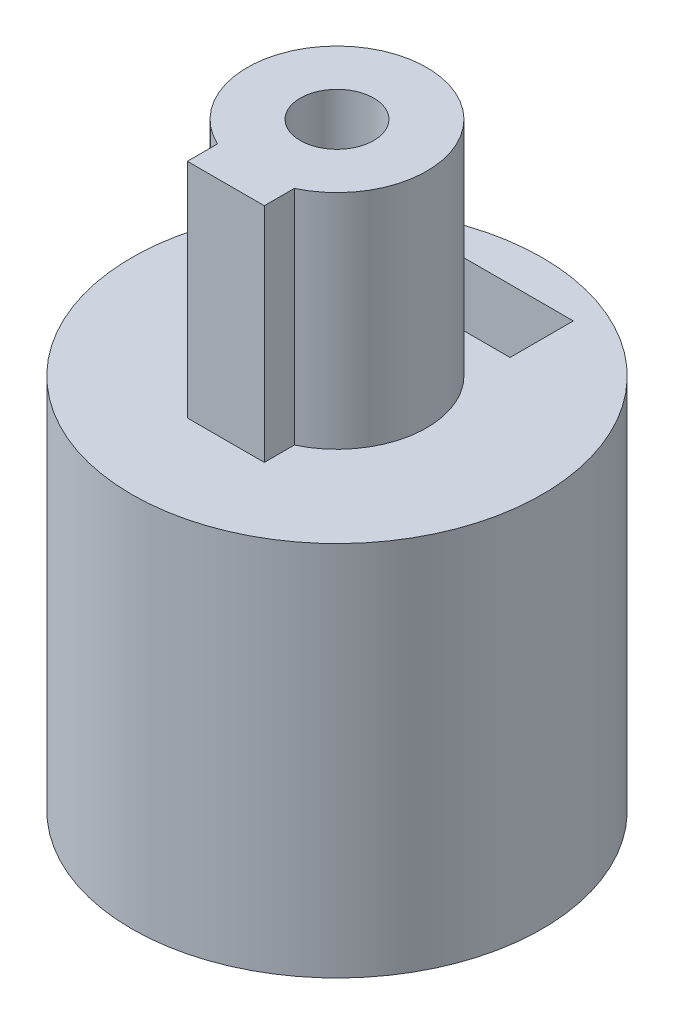
ISO-10303-21;
HEADER;
FILE_DESCRIPTION(('STEP AP214'),'2;1');
FILE_NAME('part.step','',(''),(''),'','','');
FILE_SCHEMA(('AUTOMOTIVE_DESIGN { 1 0 10303 214 1 1 1 1 }'));
ENDSEC;
DATA;
#1=APPLICATION_CONTEXT('core data for automotive mechanical design processes');
#2=APPLICATION_PROTOCOL_DEFINITION('international standard','automotive_design',2000,#1);
#3=PRODUCT_CONTEXT('',#1,'mechanical');
#4=PRODUCT('Part','Part','',(#3));
#5=PRODUCT_RELATED_PRODUCT_CATEGORY('part','',(#4));
#6=PRODUCT_DEFINITION_FORMATION('','',#4);
#7=PRODUCT_DEFINITION_CONTEXT('part definition',#1,'design');
#8=PRODUCT_DEFINITION('design','',#6,#7);
#9=PRODUCT_DEFINITION_SHAPE('','',#8);
#10=(LENGTH_UNIT() NAMED_UNIT(*) SI_UNIT(.MILLI.,.METRE.));
#11=(NAMED_UNIT(*) PLANE_ANGLE_UNIT() SI_UNIT($,.RADIAN.));
#12=(NAMED_UNIT(*) SI_UNIT($,.STERADIAN.) SOLID_ANGLE_UNIT());
#13=UNCERTAINTY_MEASURE_WITH_UNIT(LENGTH_MEASURE(1.E-05),#10,'distance_accuracy_value','');
#14=(GEOMETRIC_REPRESENTATION_CONTEXT(3) GLOBAL_UNCERTAINTY_ASSIGNED_CONTEXT((#13)) GLOBAL_UNIT_ASSIGNED_CONTEXT((#10,
#11,#12)) REPRESENTATION_CONTEXT('',''));
#15=CARTESIAN_POINT('',(0.,0.,0.));
#16=DIRECTION('',(0.,0.,1.));
#17=DIRECTION('',(1.,0.,0.));
#18=AXIS2_PLACEMENT_3D('',#15,#16,#17);
#19=CARTESIAN_POINT('',(0.,7.,-6.));
#20=DIRECTION('',(0.,0.,1.));
#21=DIRECTION('',(1.,0.,0.));
#22=AXIS2_PLACEMENT_3D('',#19,#20,#21);
#23=CYLINDRICAL_SURFACE('',#22,1.025);
#24=CARTESIAN_POINT('',(0.,8.025,-6.));
#25=CARTESIAN_POINT('',(-0.057129021805909,8.02499772840721,-5.99999900775209));
#26=CARTESIAN_POINT('',(-0.114288694426547,8.02020768113553,-5.99917558388442));
#27=CARTESIAN_POINT('',(-0.227003440677618,8.00118285182644,-5.99597008814761));
#28=CARTESIAN_POINT('',(-0.282557014382194,7.98693952098703,-5.99358660551168));
#29=CARTESIAN_POINT('',(-0.390412628331851,7.94945193314389,-5.98752819489086));
#30=CARTESIAN_POINT('',(-0.442717339459975,7.92621518637663,-5.98385434470439));
#31=CARTESIAN_POINT('',(-0.542679246717537,7.87142036283948,-5.97561861890346));
#32=CARTESIAN_POINT('',(-0.590336943676343,7.83986318416035,-5.97105683914425));
#33=CARTESIAN_POINT('',(-0.680135984205956,7.76898696325142,-5.96149941501592));
#34=CARTESIAN_POINT('',(-0.72222399560624,7.7296008182684,-5.95650024504773));
#35=CARTESIAN_POINT('',(-0.799228119899926,7.64432911453603,-5.94665830480908));
#36=CARTESIAN_POINT('',(-0.83414376866182,7.59844313549965,-5.94181554467714));
#37=CARTESIAN_POINT('',(-0.896027332048902,7.50110590633471,-5.93280057753614));
#38=CARTESIAN_POINT('',(-0.922942217268116,7.44962048335678,-5.92863292447034));
#39=CARTESIAN_POINT('',(-0.967721056978088,7.34277612409713,-5.92148911657744));
#40=CARTESIAN_POINT('',(-0.985585654718975,7.28741746342458,-5.91851287707366));
#41=CARTESIAN_POINT('',(-1.01158816944722,7.17496444613127,-5.91412405211724));
#42=CARTESIAN_POINT('',(-1.01981834503951,7.11789201196871,-5.91269664496829));
#43=CARTESIAN_POINT('',(-1.0266045006465,7.0031597815974,-5.91152229524133));
#44=CARTESIAN_POINT('',(-1.02516119995253,6.94550002937824,-5.91177522771819));
#45=CARTESIAN_POINT('',(-1.01271645572348,6.8318903608326,-5.91391945370944));
#46=CARTESIAN_POINT('',(-1.00181889187027,6.77592868044925,-5.91579294055823));
#47=CARTESIAN_POINT('',(-0.97093809525837,6.66663982621608,-5.92093928903694));
#48=CARTESIAN_POINT('',(-0.950954536531984,6.61331274696089,-5.92421220087215));
#49=CARTESIAN_POINT('',(-0.902364407216009,6.51049721851305,-5.9318077416241));
#50=CARTESIAN_POINT('',(-0.873714928690603,6.46102944752354,-5.93613557261378));
#51=CARTESIAN_POINT('',(-0.808636654316059,6.36756406826496,-5.94534973658277));
#52=CARTESIAN_POINT('',(-0.772207199569996,6.32356692381048,-5.95023611685009));
#53=CARTESIAN_POINT('',(-0.692038211440464,6.2416906191643,-5.96009492603012));
#54=CARTESIAN_POINT('',(-0.648209602257906,6.20389865817463,-5.96506764647446));
#55=CARTESIAN_POINT('',(-0.554787084587539,6.13619201555492,-5.97448004062525));
#56=CARTESIAN_POINT('',(-0.505193135382295,6.10627738956306,-5.9789197105666));
#57=CARTESIAN_POINT('',(-0.401564028575202,6.0551657177481,-5.9867725569888));
#58=CARTESIAN_POINT('',(-0.347524867685225,6.03397663545585,-5.99018479500469));
#59=CARTESIAN_POINT('',(-0.236583435115325,6.00099983015074,-5.99559083662011));
#60=CARTESIAN_POINT('',(-0.179681415700386,5.98921128033321,-5.9975847649625));
#61=CARTESIAN_POINT('',(-0.0653808172994131,5.9754889858301,-5.99991268288137));
#62=CARTESIAN_POINT('',(-0.00799700058598737,5.97343557927924,-6.00026682699029));
#63=CARTESIAN_POINT('',(0.106294577579118,5.97892246315691,-5.99933056568816));
#64=CARTESIAN_POINT('',(0.163202358214688,5.98646236508936,-5.99804022687302));
#65=CARTESIAN_POINT('',(0.274554949336557,6.01082231149179,-5.99397247481089));
#66=CARTESIAN_POINT('',(0.329013153116637,6.02758286365461,-5.99120459810796));
#67=CARTESIAN_POINT('',(0.434346698407185,6.06984473637203,-5.98449086136286));
#68=CARTESIAN_POINT('',(0.485221830138069,6.0953465681939,-5.98054493241952));
#69=CARTESIAN_POINT('',(0.58246311617523,6.15463939446082,-5.97186273771382));
#70=CARTESIAN_POINT('',(0.628783248246283,6.18850482598886,-5.96711950406798));
#71=CARTESIAN_POINT('',(0.715125836783952,6.26346146273558,-5.95738922262263));
#72=CARTESIAN_POINT('',(0.75514781070517,6.30455322110284,-5.95240215617974));
#73=CARTESIAN_POINT('',(0.828203708504393,6.39333374744174,-5.94268078613609));
#74=CARTESIAN_POINT('',(0.861156622624258,6.44108960234961,-5.93794983407302));
#75=CARTESIAN_POINT('',(0.918572497304516,6.54152931875124,-5.92933984229211));
#76=CARTESIAN_POINT('',(0.943035736678586,6.59421301833501,-5.92546077459866));
#77=CARTESIAN_POINT('',(0.982657874256186,6.70279040866835,-5.91901912534323));
#78=CARTESIAN_POINT('',(0.997856483411739,6.75866926003878,-5.91645093279999));
#79=CARTESIAN_POINT('',(1.01864245502096,6.87223450397019,-5.91290796951349));
#80=CARTESIAN_POINT('',(1.02423069968971,6.92992073012217,-5.91193305251065));
#81=CARTESIAN_POINT('',(1.02561176041543,7.04465383263375,-5.91169354428849));
#82=CARTESIAN_POINT('',(1.02153213625353,7.10169916696336,-5.91240668041866));
#83=CARTESIAN_POINT('',(1.00396974898029,7.21427885903823,-5.91541400302865));
#84=CARTESIAN_POINT('',(0.990487020878765,7.26981322240838,-5.91770818362188));
#85=CARTESIAN_POINT('',(0.954550985092882,7.37774153170815,-5.92361045759366));
#86=CARTESIAN_POINT('',(0.932109203860775,7.4301394137159,-5.92721686217777));
#87=CARTESIAN_POINT('',(0.878905351085741,7.53044701229056,-5.9353387767073));
#88=CARTESIAN_POINT('',(0.848142832774205,7.57835648767366,-5.93985433546496));
#89=CARTESIAN_POINT('',(0.778717727996033,7.66897074088246,-5.94935610169176));
#90=CARTESIAN_POINT('',(0.739961482891463,7.71160323040603,-5.95434747238202));
#91=CARTESIAN_POINT('',(0.655846210332251,7.78980307156242,-5.96419777785053));
#92=CARTESIAN_POINT('',(0.610485663211634,7.82536879264853,-5.96905668184154));
#93=CARTESIAN_POINT('',(0.514055463609574,7.88866371595542,-5.9781357643754));
#94=CARTESIAN_POINT('',(0.462946585113283,7.91633387123849,-5.98235102595813));
#95=CARTESIAN_POINT('',(0.356753960873555,7.9626528304007,-5.98962003307112));
#96=CARTESIAN_POINT('',(0.301674193065421,7.98131052229395,-5.99267492231261));
#97=CARTESIAN_POINT('',(0.205324889668461,8.00507473985857,-5.99662063052046));
#98=CARTESIAN_POINT('',(0.164634720196102,8.01253459518788,-5.99788104819846));
#99=CARTESIAN_POINT('',(0.0826350389649352,8.02249800067083,-5.99957108407766));
#100=CARTESIAN_POINT('',(0.0413255387647287,8.02500164320678,-6.00000071776442));
#101=CARTESIAN_POINT('',(0.,8.025,-6.));
#102=B_SPLINE_CURVE_WITH_KNOTS('',3,(#24,#25,#26,#27,#28,#29,#30,#31,#32,#33,#34,#35,#36,#37,
#38,#39,#40,#41,#42,#43,#44,#45,#46,#47,#48,#49,#50,#51,#52,#53,#54,#55,#56,#57,#58,#59,#60,#61,
#62,#63,#64,#65,#66,#67,#68,#69,#70,#71,#72,#73,#74,#75,#76,#77,#78,#79,#80,#81,#82,#83,#84,#85,
#86,#87,#88,#89,#90,#91,#92,#93,#94,#95,#96,#97,#98,#99,#100,#101),.UNSPECIFIED.,.T.,.F.,(4,2,2,
2,2,2,2,2,2,2,2,2,2,2,2,2,2,2,2,2,2,2,2,2,2,2,2,2,2,2,2,2,2,2,2,2,2,2,4),(0.,0.171235994893447,
0.342627053456379,0.513875294237687,0.685105058388228,0.857871180813246,1.03064847960544,
1.20454664979448,1.37843245841822,1.55063916189725,1.72283306073277,1.89315858532088,
2.06349022096238,2.23467942944234,2.40588314192621,2.57931792140326,2.75275392582942,
2.92634787091466,3.0999265462136,3.27136600700557,3.44279852530835,3.61313770472599,
3.78348684878489,3.95541050932786,4.12734733572354,4.30116013270972,4.4749672208821,
4.64802398347102,4.821064858896,4.99183533604723,5.16260517738581,5.33315601574305,
5.50371601337198,5.67640118185052,5.84912614859001,6.02311087172201,6.19692366051839,
6.32079330552967,6.44466064162599),.UNSPECIFIED.);
#103=CARTESIAN_POINT('',(0.,8.025,-6.));
#104=VERTEX_POINT('',#103);
#105=EDGE_CURVE('E251',#104,#104,#102,.T.);
#106=ORIENTED_EDGE('',*,*,#105,.F.);
#107=EDGE_LOOP('',(#106));
#108=FACE_BOUND('',#107,.T.);
#109=CARTESIAN_POINT('',(0.,7.,-4.85));
#110=DIRECTION('',(0.,0.,1.));
#111=DIRECTION('',(1.,0.,0.));
#112=AXIS2_PLACEMENT_3D('',#109,#110,#111);
#113=CIRCLE('',#112,1.025);
#114=CARTESIAN_POINT('',(1.025,7.,-4.85));
#115=VERTEX_POINT('',#114);
#116=EDGE_CURVE('E186',#115,#115,#113,.F.);
#117=ORIENTED_EDGE('',*,*,#116,.F.);
#118=EDGE_LOOP('',(#117));
#119=FACE_BOUND('',#118,.T.);
#120=ADVANCED_FACE('F49',(#108,#119),#23,.F.);
#121=CARTESIAN_POINT('',(0.,11.,0.));
#122=DIRECTION('',(0.,1.,0.));
#123=DIRECTION('',(0.,0.,1.));
#124=AXIS2_PLACEMENT_3D('',#121,#122,#123);
#125=PLANE('',#124);
#126=DIRECTION('',(0.,0.,1.));
#127=VECTOR('',#126,1.);
#128=CARTESIAN_POINT('',(-1.125,11.,0.));
#129=LINE('',#128,#127);
#130=CARTESIAN_POINT('',(-1.125,11.,2.37170824512628));
#131=VERTEX_POINT('',#130);
#132=CARTESIAN_POINT('',(-1.125,11.,3.25));
#133=VERTEX_POINT('',#132);
#134=EDGE_CURVE('E73',#131,#133,#129,.T.);
#135=ORIENTED_EDGE('',*,*,#134,.F.);
#136=CARTESIAN_POINT('',(0.,11.,0.));
#137=DIRECTION('',(0.,1.,0.));
#138=DIRECTION('',(0.,0.,1.));
#139=AXIS2_PLACEMENT_3D('',#136,#137,#138);
#140=CIRCLE('',#139,2.625);
#141=CARTESIAN_POINT('',(1.125,11.,2.37170824512628));
#142=VERTEX_POINT('',#141);
#143=EDGE_CURVE('E193',#142,#131,#140,.T.);
#144=ORIENTED_EDGE('',*,*,#143,.F.);
#145=DIRECTION('',(0.,0.,1.));
#146=VECTOR('',#145,1.);
#147=CARTESIAN_POINT('',(1.125,11.,0.));
#148=LINE('',#147,#146);
#149=CARTESIAN_POINT('',(1.125,11.,3.25));
#150=VERTEX_POINT('',#149);
#151=EDGE_CURVE('E199',#142,#150,#148,.T.);
#152=ORIENTED_EDGE('',*,*,#151,.T.);
#153=DIRECTION('',(1.,0.,0.));
#154=VECTOR('',#153,1.);
#155=CARTESIAN_POINT('',(0.,11.,3.25));
#156=LINE('',#155,#154);
#157=EDGE_CURVE('E206',#133,#150,#156,.T.);
#158=ORIENTED_EDGE('',*,*,#157,.F.);
#159=EDGE_LOOP('',(#135,#144,#152,#158));
#160=FACE_BOUND('',#159,.T.);
#161=CARTESIAN_POINT('',(0.,11.,0.));
#162=DIRECTION('',(0.,1.,0.));
#163=DIRECTION('',(0.,0.,1.));
#164=AXIS2_PLACEMENT_3D('',#161,#162,#163);
#165=CIRCLE('',#164,6.);
#166=CARTESIAN_POINT('',(0.,11.,6.));
#167=VERTEX_POINT('',#166);
#168=EDGE_CURVE('E221',#167,#167,#165,.T.);
#169=ORIENTED_EDGE('',*,*,#168,.T.);
#170=EDGE_LOOP('',(#169));
#171=FACE_BOUND('',#170,.T.);
#172=DIRECTION('',(0.,0.,-1.));
#173=VECTOR('',#172,1.);
#174=CARTESIAN_POINT('',(-2.06,11.,0.));
#175=LINE('',#174,#173);
#176=CARTESIAN_POINT('',(-2.06,11.,-3.));
#177=VERTEX_POINT('',#176);
#178=CARTESIAN_POINT('',(-2.06,11.,-4.85));
#179=VERTEX_POINT('',#178);
#180=EDGE_CURVE('E369',#177,#179,#175,.T.);
#181=ORIENTED_EDGE('',*,*,#180,.T.);
#182=DIRECTION('',(1.,0.,0.));
#183=VECTOR('',#182,1.);
#184=CARTESIAN_POINT('',(0.,11.,-4.85));
#185=LINE('',#184,#183);
#186=CARTESIAN_POINT('',(2.06,11.,-4.85));
#187=VERTEX_POINT('',#186);
#188=EDGE_CURVE('E12',#179,#187,#185,.T.);
#189=ORIENTED_EDGE('',*,*,#188,.T.);
#190=DIRECTION('',(0.,0.,-1.));
#191=VECTOR('',#190,1.);
#192=CARTESIAN_POINT('',(2.06,11.,0.));
#193=LINE('',#192,#191);
#194=CARTESIAN_POINT('',(2.06,11.,-3.));
#195=VERTEX_POINT('',#194);
#196=EDGE_CURVE('E58',#195,#187,#193,.T.);
#197=ORIENTED_EDGE('',*,*,#196,.F.);
#198=DIRECTION('',(1.,0.,0.));
#199=VECTOR('',#198,1.);
#200=CARTESIAN_POINT('',(0.,11.,-3.));
#201=LINE('',#200,#199);
#202=EDGE_CURVE('E366',#177,#195,#201,.T.);
#203=ORIENTED_EDGE('',*,*,#202,.F.);
#204=EDGE_LOOP('',(#181,#189,#197,#203));
#205=FACE_BOUND('',#204,.T.);
#206=ADVANCED_FACE('F265',(#160,#171,#205),#125,.T.);
#207=CARTESIAN_POINT('',(0.,7.,-3.));
#208=DIRECTION('',(0.,0.,1.));
#209=DIRECTION('',(1.,0.,0.));
#210=AXIS2_PLACEMENT_3D('',#207,#208,#209);
#211=CIRCLE('',#210,1.025);
#212=CARTESIAN_POINT('',(1.025,7.,-3.));
#213=VERTEX_POINT('',#212);
#214=EDGE_CURVE('E182',#213,#213,#211,.F.);
#215=ORIENTED_EDGE('',*,*,#214,.T.);
#216=EDGE_LOOP('',(#215));
#217=FACE_BOUND('',#216,.T.);
#218=CARTESIAN_POINT('',(1.025,7.,-1.8328597873269));
#219=CARTESIAN_POINT('',(1.02499645606672,6.94639441501386,-1.8328640935936));
#220=CARTESIAN_POINT('',(1.02076698915576,6.89271673931753,-1.83524689686831));
#221=CARTESIAN_POINT('',(1.00405753177462,6.78699322302765,-1.84443863790037));
#222=CARTESIAN_POINT('',(0.991559385204819,6.73495123803985,-1.85125731525541));
#223=CARTESIAN_POINT('',(0.958969452031826,6.63422602594403,-1.86834445087353));
#224=CARTESIAN_POINT('',(0.938916546275438,6.58552708573205,-1.87859521620438));
#225=CARTESIAN_POINT('',(0.891904667350708,6.49219655437279,-1.90136426661631));
#226=CARTESIAN_POINT('',(0.86494560626241,6.44756501501604,-1.91388258056418));
#227=CARTESIAN_POINT('',(0.802406461176824,6.35976841775886,-1.94097712724614));
#228=CARTESIAN_POINT('',(0.76631621169833,6.31699262925037,-1.95563775587243));
#229=CARTESIAN_POINT('',(0.687601665544952,6.23780053169204,-1.98468238424946));
#230=CARTESIAN_POINT('',(0.644974255849895,6.20138727026928,-1.99906624851168));
#231=CARTESIAN_POINT('',(0.551085323966481,6.13369416463791,-2.02702988673331));
#232=CARTESIAN_POINT('',(0.499447438646706,6.1028870633247,-2.04050061684691));
#233=CARTESIAN_POINT('',(0.390941700361152,6.05057369031554,-2.06403433745223));
#234=CARTESIAN_POINT('',(0.334077021041106,6.02906181932189,-2.0740993786814));
#235=CARTESIAN_POINT('',(0.220850829971725,5.99747108161938,-2.0890810601881));
#236=CARTESIAN_POINT('',(0.164720524014055,5.9867113351402,-2.09430254212573));
#237=CARTESIAN_POINT('',(0.051226688237023,5.97469434357093,-2.10014221364635));
#238=CARTESIAN_POINT('',(-0.00613611638643622,5.9734316561337,-2.10076303966004));
#239=CARTESIAN_POINT('',(-0.115373787896629,5.98016733482283,-2.09748142204962));
#240=CARTESIAN_POINT('',(-0.167309127918126,5.98740606138804,-2.09394997215738));
#241=CARTESIAN_POINT('',(-0.269118447664813,6.00958845399914,-2.08331360243167));
#242=CARTESIAN_POINT('',(-0.318992273374222,6.02453269460435,-2.07620841612459));
#243=CARTESIAN_POINT('',(-0.416153475149913,6.06181599855391,-2.05895316401618));
#244=CARTESIAN_POINT('',(-0.463393645521308,6.0842577879692,-2.04876099467317));
#245=CARTESIAN_POINT('',(-0.553555137985415,6.13576603981873,-2.02626233951311));
#246=CARTESIAN_POINT('',(-0.596474885223051,6.16483490540072,-2.01395508711223));
#247=CARTESIAN_POINT('',(-0.680950591937614,6.23182288394922,-1.98706966262833));
#248=CARTESIAN_POINT('',(-0.722025366910624,6.27030729322842,-1.97238674800569));
#249=CARTESIAN_POINT('',(-0.797390648207704,6.35351140450009,-1.94314322644075));
#250=CARTESIAN_POINT('',(-0.831676359665604,6.398235475605,-1.92858271284636));
#251=CARTESIAN_POINT('',(-0.894440298131244,6.49585680971974,-1.90032382253067));
#252=CARTESIAN_POINT('',(-0.922462951327314,6.54907869752364,-1.88672531915229));
#253=CARTESIAN_POINT('',(-0.96894590420928,6.66030599943166,-1.86328435122403));
#254=CARTESIAN_POINT('',(-0.987415779354138,6.71830655563035,-1.8534381281014));
#255=CARTESIAN_POINT('',(-1.01281094431499,6.83267702014528,-1.83967626974392));
#256=CARTESIAN_POINT('',(-1.02052340819776,6.88882204147189,-1.83535842629193));
#257=CARTESIAN_POINT('',(-1.02655429914469,7.00175736510262,-1.83199386873751));
#258=CARTESIAN_POINT('',(-1.02487867862491,7.05854723575392,-1.8329438146448));
#259=CARTESIAN_POINT('',(-1.01290336244989,7.16500613780785,-1.83958207082481));
#260=CARTESIAN_POINT('',(-1.00349913481734,7.21481145819679,-1.84477807629652));
#261=CARTESIAN_POINT('',(-0.97764080378385,7.31205146938064,-1.85861017566643));
#262=CARTESIAN_POINT('',(-0.961184545663605,7.35948543066588,-1.8672473209342));
#263=CARTESIAN_POINT('',(-0.920877212448492,7.45313319715334,-1.88746229884837));
#264=CARTESIAN_POINT('',(-0.896718260907304,7.49918808483605,-1.8991580519879));
#265=CARTESIAN_POINT('',(-0.841964328451563,7.58685190346573,-1.92405824492246));
#266=CARTESIAN_POINT('',(-0.811366070887822,7.62845855460489,-1.93726345123587));
#267=CARTESIAN_POINT('',(-0.740342279000108,7.71121992313739,-1.96558410337199));
#268=CARTESIAN_POINT('',(-0.69918069475161,7.75173205120026,-1.98073991430063));
#269=CARTESIAN_POINT('',(-0.610382766986843,7.82546278133421,-2.00987952889889));
#270=CARTESIAN_POINT('',(-0.562744561425936,7.85867927868379,-2.02386299364009));
#271=CARTESIAN_POINT('',(-0.460883657472091,7.91746450829215,-2.04948776215532));
#272=CARTESIAN_POINT('',(-0.406539905583028,7.94285042833359,-2.06107126229387));
#273=CARTESIAN_POINT('',(-0.293626072478352,7.98387415378924,-2.08015652924546));
#274=CARTESIAN_POINT('',(-0.235059573883659,7.9995201165781,-2.08766171104581));
#275=CARTESIAN_POINT('',(-0.120985244570837,8.01933122776103,-2.097222972226));
#276=CARTESIAN_POINT('',(-0.0656684200114454,8.02439343629108,-2.09970419445187));
#277=CARTESIAN_POINT('',(0.0450695482203038,8.02550307041801,-2.10024529201488));
#278=CARTESIAN_POINT('',(0.100490653193746,8.02155335778316,-2.0983065709212));
#279=CARTESIAN_POINT('',(0.206321200093286,8.00535989483666,-2.09047330467869));
#280=CARTESIAN_POINT('',(0.256830362999739,7.99363561192035,-2.08482672187127));
#281=CARTESIAN_POINT('',(0.355092191206429,7.96290490339736,-2.07035688277301));
#282=CARTESIAN_POINT('',(0.402844441603459,7.94389738496598,-2.06153314977358));
#283=CARTESIAN_POINT('',(0.496586623318674,7.89825594380281,-2.04103045697026));
#284=CARTESIAN_POINT('',(0.542406774569577,7.87132346786946,-2.02924302326906));
#285=CARTESIAN_POINT('',(0.629072329503909,7.81097754898362,-2.00407282256472));
#286=CARTESIAN_POINT('',(0.669915429297153,7.77756112300753,-1.99068932236731));
#287=CARTESIAN_POINT('',(0.749562379479787,7.70149527070206,-1.96217008137833));
#288=CARTESIAN_POINT('',(0.787801132441636,7.65826948400864,-1.94698888727679));
#289=CARTESIAN_POINT('',(0.856672139734532,7.56574344799832,-1.91768544090081));
#290=CARTESIAN_POINT('',(0.887298192258421,7.5164382946262,-1.90356405851341));
#291=CARTESIAN_POINT('',(0.940664590894157,7.41149172262077,-1.87777865534351));
#292=CARTESIAN_POINT('',(0.963192351888686,7.35572424310986,-1.86618365252134));
#293=CARTESIAN_POINT('',(0.998195400216386,7.24047893595184,-1.84770353057538));
#294=CARTESIAN_POINT('',(1.01070439407466,7.18101428083051,-1.84080263081204));
#295=CARTESIAN_POINT('',(1.02023257777911,7.10079837224774,-1.83551880194986));
#296=CARTESIAN_POINT('',(1.02201786408671,7.0806969803855,-1.83452480173931));
#297=CARTESIAN_POINT('',(1.0244022799265,7.04040047690318,-1.83319446243567));
#298=CARTESIAN_POINT('',(1.02500133580197,7.02020535954143,-1.83285816418134));
#299=CARTESIAN_POINT('',(1.025,7.,-1.8328597873269));
#300=B_SPLINE_CURVE_WITH_KNOTS('',3,(#218,#219,#220,#221,#222,#223,#224,#225,#226,#227,#228,
#229,#230,#231,#232,#233,#234,#235,#236,#237,#238,#239,#240,#241,#242,#243,#244,#245,#246,#247,
#248,#249,#250,#251,#252,#253,#254,#255,#256,#257,#258,#259,#260,#261,#262,#263,#264,#265,#266,
#267,#268,#269,#270,#271,#272,#273,#274,#275,#276,#277,#278,#279,#280,#281,#282,#283,#284,#285,
#286,#287,#288,#289,#290,#291,#292,#293,#294,#295,#296,#297,#298,#299),.UNSPECIFIED.,.T.,.F.,(4,
2,2,2,2,2,2,2,2,2,2,2,2,2,2,2,2,2,2,2,2,2,2,2,2,2,2,2,2,2,2,2,2,2,2,2,2,2,2,2,4),(0.,
0.160731801023403,0.32181770831564,0.482085661754884,0.642355655613302,0.815190188583738,
0.988107283055588,1.17200361229614,1.35578901037865,1.52701416065222,1.69814118183609,
1.85507088468206,2.01201229063649,2.17119877081237,2.33044306816614,2.50420740726671,
2.67809403541448,2.86212648314324,3.04597410221588,3.21550139929675,3.38492122154889,
3.53709084957253,3.68930700559683,3.8485908324795,4.00795590797556,4.18627953834882,
4.36465454605353,4.54692411187511,4.72904081783061,4.89496590268103,5.06083830475238,
5.21661452596801,5.37241413003437,5.53506342110908,5.69778771924206,5.87601659912541,
6.05439020359655,6.23715299662205,6.41929830006472,6.47987859580963,6.54046265305402),.UNSPECIFIED.);
#301=CARTESIAN_POINT('',(1.025,7.,-1.8328597873269));
#302=VERTEX_POINT('',#301);
#303=EDGE_CURVE('E244',#302,#302,#300,.T.);
#304=ORIENTED_EDGE('',*,*,#303,.F.);
#305=EDGE_LOOP('',(#304));
#306=FACE_BOUND('',#305,.T.);
#307=ADVANCED_FACE('F262',(#217,#306),#23,.F.);
#308=CARTESIAN_POINT('',(0.,10.,0.));
#309=DIRECTION('',(0.,-1.,0.));
#310=DIRECTION('',(0.,0.,-1.));
#311=AXIS2_PLACEMENT_3D('',#308,#309,#310);
#312=CYLINDRICAL_SURFACE('',#311,6.);
#313=ORIENTED_EDGE('',*,*,#105,.T.);
#314=EDGE_LOOP('',(#313));
#315=FACE_BOUND('',#314,.T.);
#316=CARTESIAN_POINT('',(0.,0.,0.));
#317=DIRECTION('',(0.,1.,0.));
#318=DIRECTION('',(0.,0.,1.));
#319=AXIS2_PLACEMENT_3D('',#316,#317,#318);
#320=CIRCLE('',#319,6.);
#321=CARTESIAN_POINT('',(0.,0.,6.));
#322=VERTEX_POINT('',#321);
#323=EDGE_CURVE('E248',#322,#322,#320,.T.);
#324=ORIENTED_EDGE('',*,*,#323,.T.);
#325=EDGE_LOOP('',(#324));
#326=FACE_BOUND('',#325,.T.);
#327=ORIENTED_EDGE('',*,*,#168,.F.);
#328=EDGE_LOOP('',(#327));
#329=FACE_BOUND('',#328,.T.);
#330=ADVANCED_FACE('F51',(#315,#326,#329),#312,.T.);
#331=CARTESIAN_POINT('',(0.,0.,0.));
#332=DIRECTION('',(0.,1.,0.));
#333=DIRECTION('',(0.,0.,1.));
#334=AXIS2_PLACEMENT_3D('',#331,#332,#333);
#335=PLANE('',#334);
#336=CARTESIAN_POINT('',(0.,0.,0.));
#337=DIRECTION('',(0.,1.,0.));
#338=DIRECTION('',(0.,0.,1.));
#339=AXIS2_PLACEMENT_3D('',#336,#337,#338);
#340=CIRCLE('',#339,2.1);
#341=CARTESIAN_POINT('',(0.,0.,2.1));
#342=VERTEX_POINT('',#341);
#343=EDGE_CURVE('E236',#342,#342,#340,.T.);
#344=ORIENTED_EDGE('',*,*,#343,.T.);
#345=EDGE_LOOP('',(#344));
#346=FACE_BOUND('',#345,.T.);
#347=ORIENTED_EDGE('',*,*,#323,.F.);
#348=EDGE_LOOP('',(#347));
#349=FACE_BOUND('',#348,.T.);
#350=ADVANCED_FACE('F270',(#346,#349),#335,.F.);
#351=CARTESIAN_POINT('',(0.,10.,0.));
#352=DIRECTION('',(0.,-1.,0.));
#353=DIRECTION('',(0.,0.,-1.));
#354=AXIS2_PLACEMENT_3D('',#351,#352,#353);
#355=CYLINDRICAL_SURFACE('',#354,2.1);
#356=DIRECTION('',(0.,-1.,0.));
#357=VECTOR('',#356,1.);
#358=CARTESIAN_POINT('',(0.475,10.,2.04557449143266));
#359=LINE('',#358,#357);
#360=CARTESIAN_POINT('',(0.475,10.,2.04557449143266));
#361=VERTEX_POINT('',#360);
#362=CARTESIAN_POINT('',(0.475,8.8,2.04557449143266));
#363=VERTEX_POINT('',#362);
#364=EDGE_CURVE('E358',#361,#363,#359,.T.);
#365=ORIENTED_EDGE('',*,*,#364,.F.);
#366=CARTESIAN_POINT('',(0.,10.,0.));
#367=DIRECTION('',(0.,1.,0.));
#368=DIRECTION('',(0.,0.,1.));
#369=AXIS2_PLACEMENT_3D('',#366,#367,#368);
#370=CIRCLE('',#369,2.1);
#371=CARTESIAN_POINT('',(0.475,10.,-2.04557449143266));
#372=VERTEX_POINT('',#371);
#373=EDGE_CURVE('E241',#361,#372,#370,.T.);
#374=ORIENTED_EDGE('',*,*,#373,.T.);
#375=DIRECTION('',(0.,-1.,0.));
#376=VECTOR('',#375,1.);
#377=CARTESIAN_POINT('',(0.475,10.,-2.04557449143266));
#378=LINE('',#377,#376);
#379=CARTESIAN_POINT('',(0.475,8.8,-2.04557449143266));
#380=VERTEX_POINT('',#379);
#381=EDGE_CURVE('E360',#380,#372,#378,.F.);
#382=ORIENTED_EDGE('',*,*,#381,.F.);
#383=CARTESIAN_POINT('',(0.,8.8,0.));
#384=DIRECTION('',(0.,-1.,0.));
#385=DIRECTION('',(0.,0.,-1.));
#386=AXIS2_PLACEMENT_3D('',#383,#384,#385);
#387=CIRCLE('',#386,2.1);
#388=CARTESIAN_POINT('',(-0.475,8.8,-2.04557449143266));
#389=VERTEX_POINT('',#388);
#390=EDGE_CURVE('E257',#389,#380,#387,.T.);
#391=ORIENTED_EDGE('',*,*,#390,.F.);
#392=DIRECTION('',(0.,-1.,0.));
#393=VECTOR('',#392,1.);
#394=CARTESIAN_POINT('',(-0.475,10.,-2.04557449143266));
#395=LINE('',#394,#393);
#396=CARTESIAN_POINT('',(-0.475,10.,-2.04557449143266));
#397=VERTEX_POINT('',#396);
#398=EDGE_CURVE('E387',#397,#389,#395,.T.);
#399=ORIENTED_EDGE('',*,*,#398,.F.);
#400=CARTESIAN_POINT('',(-0.475,10.,2.04557449143266));
#401=VERTEX_POINT('',#400);
#402=EDGE_CURVE('E245',#397,#401,#370,.T.);
#403=ORIENTED_EDGE('',*,*,#402,.T.);
#404=DIRECTION('',(0.,-1.,0.));
#405=VECTOR('',#404,1.);
#406=CARTESIAN_POINT('',(-0.475,10.,2.04557449143266));
#407=LINE('',#406,#405);
#408=CARTESIAN_POINT('',(-0.475,8.8,2.04557449143266));
#409=VERTEX_POINT('',#408);
#410=EDGE_CURVE('E367',#409,#401,#407,.F.);
#411=ORIENTED_EDGE('',*,*,#410,.F.);
#412=EDGE_CURVE('E365',#363,#409,#387,.T.);
#413=ORIENTED_EDGE('',*,*,#412,.F.);
#414=EDGE_LOOP('',(#365,#374,#382,#391,#399,#403,#411,#413));
#415=FACE_BOUND('',#414,.T.);
#416=ORIENTED_EDGE('',*,*,#343,.F.);
#417=EDGE_LOOP('',(#416));
#418=FACE_BOUND('',#417,.T.);
#419=ORIENTED_EDGE('',*,*,#303,.T.);
#420=EDGE_LOOP('',(#419));
#421=FACE_BOUND('',#420,.T.);
#422=ADVANCED_FACE('F267',(#415,#418,#421),#355,.F.);
#423=CARTESIAN_POINT('',(0.,8.8,0.));
#424=DIRECTION('',(0.,-1.,0.));
#425=DIRECTION('',(0.,0.,-1.));
#426=AXIS2_PLACEMENT_3D('',#423,#424,#425);
#427=PLANE('',#426);
#428=DIRECTION('',(0.,0.,-1.));
#429=VECTOR('',#428,1.);
#430=CARTESIAN_POINT('',(0.475,8.8,3.53457335348961));
#431=LINE('',#430,#429);
#432=EDGE_CURVE('E229',#363,#380,#431,.T.);
#433=ORIENTED_EDGE('',*,*,#432,.F.);
#434=ORIENTED_EDGE('',*,*,#412,.T.);
#435=DIRECTION('',(0.,0.,1.));
#436=VECTOR('',#435,1.);
#437=CARTESIAN_POINT('',(-0.475,8.8,3.53457335348961));
#438=LINE('',#437,#436);
#439=EDGE_CURVE('E232',#389,#409,#438,.T.);
#440=ORIENTED_EDGE('',*,*,#439,.F.);
#441=ORIENTED_EDGE('',*,*,#390,.T.);
#442=EDGE_LOOP('',(#433,#434,#440,#441));
#443=FACE_BOUND('',#442,.T.);
#444=ADVANCED_FACE('F278',(#443),#427,.T.);
#445=CARTESIAN_POINT('',(0.475,8.8,3.53457335348961));
#446=DIRECTION('',(1.,0.,0.));
#447=DIRECTION('',(0.,0.,-1.));
#448=AXIS2_PLACEMENT_3D('',#445,#446,#447);
#449=PLANE('',#448);
#450=DIRECTION('',(0.,0.,-1.));
#451=VECTOR('',#450,1.);
#452=CARTESIAN_POINT('',(0.475,10.,3.53457335348961));
#453=LINE('',#452,#451);
#454=EDGE_CURVE('E228',#361,#372,#453,.T.);
#455=ORIENTED_EDGE('',*,*,#454,.F.);
#456=ORIENTED_EDGE('',*,*,#364,.T.);
#457=ORIENTED_EDGE('',*,*,#432,.T.);
#458=ORIENTED_EDGE('',*,*,#381,.T.);
#459=EDGE_LOOP('',(#455,#456,#457,#458));
#460=FACE_BOUND('',#459,.T.);
#461=ADVANCED_FACE('F347',(#460),#449,.T.);
#462=CARTESIAN_POINT('',(-0.475,8.8,3.53457335348961));
#463=DIRECTION('',(-1.,0.,0.));
#464=DIRECTION('',(0.,0.,1.));
#465=AXIS2_PLACEMENT_3D('',#462,#463,#464);
#466=PLANE('',#465);
#467=DIRECTION('',(0.,0.,1.));
#468=VECTOR('',#467,1.);
#469=CARTESIAN_POINT('',(-0.475,10.,3.53457335348961));
#470=LINE('',#469,#468);
#471=EDGE_CURVE('E233',#397,#401,#470,.T.);
#472=ORIENTED_EDGE('',*,*,#471,.F.);
#473=ORIENTED_EDGE('',*,*,#398,.T.);
#474=ORIENTED_EDGE('',*,*,#439,.T.);
#475=ORIENTED_EDGE('',*,*,#410,.T.);
#476=EDGE_LOOP('',(#472,#473,#474,#475));
#477=FACE_BOUND('',#476,.T.);
#478=ADVANCED_FACE('F343',(#477),#466,.T.);
#479=CARTESIAN_POINT('',(0.,10.,0.));
#480=DIRECTION('',(0.,1.,0.));
#481=DIRECTION('',(0.,0.,1.));
#482=AXIS2_PLACEMENT_3D('',#479,#480,#481);
#483=PLANE('',#482);
#484=ORIENTED_EDGE('',*,*,#402,.F.);
#485=ORIENTED_EDGE('',*,*,#471,.T.);
#486=EDGE_LOOP('',(#484,#485));
#487=FACE_BOUND('',#486,.T.);
#488=ADVANCED_FACE('F340',(#487),#483,.F.);
#489=ORIENTED_EDGE('',*,*,#373,.F.);
#490=ORIENTED_EDGE('',*,*,#454,.T.);
#491=EDGE_LOOP('',(#489,#490));
#492=FACE_BOUND('',#491,.T.);
#493=ADVANCED_FACE('F335',(#492),#483,.F.);
#494=CARTESIAN_POINT('',(-1.125,17.5,0.));
#495=DIRECTION('',(1.,0.,0.));
#496=DIRECTION('',(0.,0.,-1.));
#497=AXIS2_PLACEMENT_3D('',#494,#495,#496);
#498=PLANE('',#497);
#499=ORIENTED_EDGE('',*,*,#134,.T.);
#500=DIRECTION('',(0.,-1.,0.));
#501=VECTOR('',#500,1.);
#502=CARTESIAN_POINT('',(-1.125,17.5,3.25));
#503=LINE('',#502,#501);
#504=CARTESIAN_POINT('',(-1.125,17.5,3.25));
#505=VERTEX_POINT('',#504);
#506=EDGE_CURVE('E216',#505,#133,#503,.T.);
#507=ORIENTED_EDGE('',*,*,#506,.F.);
#508=DIRECTION('',(0.,0.,1.));
#509=VECTOR('',#508,1.);
#510=CARTESIAN_POINT('',(-1.125,17.5,0.));
#511=LINE('',#510,#509);
#512=CARTESIAN_POINT('',(-1.125,17.5,2.37170824512628));
#513=VERTEX_POINT('',#512);
#514=EDGE_CURVE('E196',#513,#505,#511,.T.);
#515=ORIENTED_EDGE('',*,*,#514,.F.);
#516=DIRECTION('',(0.,-1.,0.));
#517=VECTOR('',#516,1.);
#518=CARTESIAN_POINT('',(-1.125,17.5,2.37170824512628));
#519=LINE('',#518,#517);
#520=EDGE_CURVE('E219',#513,#131,#519,.T.);
#521=ORIENTED_EDGE('',*,*,#520,.T.);
#522=EDGE_LOOP('',(#499,#507,#515,#521));
#523=FACE_BOUND('',#522,.T.);
#524=ADVANCED_FACE('F331',(#523),#498,.F.);
#525=CARTESIAN_POINT('',(0.,17.5,3.25));
#526=DIRECTION('',(0.,0.,-1.));
#527=DIRECTION('',(-1.,0.,0.));
#528=AXIS2_PLACEMENT_3D('',#525,#526,#527);
#529=PLANE('',#528);
#530=ORIENTED_EDGE('',*,*,#157,.T.);
#531=DIRECTION('',(0.,-1.,0.));
#532=VECTOR('',#531,1.);
#533=CARTESIAN_POINT('',(1.125,17.5,3.25));
#534=LINE('',#533,#532);
#535=CARTESIAN_POINT('',(1.125,17.5,3.25));
#536=VERTEX_POINT('',#535);
#537=EDGE_CURVE('E213',#536,#150,#534,.T.);
#538=ORIENTED_EDGE('',*,*,#537,.F.);
#539=DIRECTION('',(1.,0.,0.));
#540=VECTOR('',#539,1.);
#541=CARTESIAN_POINT('',(0.,17.5,3.25));
#542=LINE('',#541,#540);
#543=EDGE_CURVE('E198',#505,#536,#542,.T.);
#544=ORIENTED_EDGE('',*,*,#543,.F.);
#545=ORIENTED_EDGE('',*,*,#506,.T.);
#546=EDGE_LOOP('',(#530,#538,#544,#545));
#547=FACE_BOUND('',#546,.T.);
#548=ADVANCED_FACE('F327',(#547),#529,.F.);
#549=CARTESIAN_POINT('',(1.125,17.5,0.));
#550=DIRECTION('',(1.,0.,0.));
#551=DIRECTION('',(0.,0.,-1.));
#552=AXIS2_PLACEMENT_3D('',#549,#550,#551);
#553=PLANE('',#552);
#554=ORIENTED_EDGE('',*,*,#151,.F.);
#555=DIRECTION('',(0.,-1.,0.));
#556=VECTOR('',#555,1.);
#557=CARTESIAN_POINT('',(1.125,17.5,2.37170824512628));
#558=LINE('',#557,#556);
#559=CARTESIAN_POINT('',(1.125,17.5,2.37170824512628));
#560=VERTEX_POINT('',#559);
#561=EDGE_CURVE('E204',#560,#142,#558,.T.);
#562=ORIENTED_EDGE('',*,*,#561,.F.);
#563=DIRECTION('',(0.,0.,1.));
#564=VECTOR('',#563,1.);
#565=CARTESIAN_POINT('',(1.125,17.5,0.));
#566=LINE('',#565,#564);
#567=EDGE_CURVE('E201',#560,#536,#566,.T.);
#568=ORIENTED_EDGE('',*,*,#567,.T.);
#569=ORIENTED_EDGE('',*,*,#537,.T.);
#570=EDGE_LOOP('',(#554,#562,#568,#569));
#571=FACE_BOUND('',#570,.T.);
#572=ADVANCED_FACE('F323',(#571),#553,.T.);
#573=CARTESIAN_POINT('',(0.,17.5,0.));
#574=DIRECTION('',(0.,1.,0.));
#575=DIRECTION('',(0.,0.,1.));
#576=AXIS2_PLACEMENT_3D('',#573,#574,#575);
#577=PLANE('',#576);
#578=CARTESIAN_POINT('',(0.,17.5,0.));
#579=DIRECTION('',(0.,1.,0.));
#580=DIRECTION('',(0.,0.,1.));
#581=AXIS2_PLACEMENT_3D('',#578,#579,#580);
#582=CIRCLE('',#581,1.075);
#583=CARTESIAN_POINT('',(0.,17.5,1.075));
#584=VERTEX_POINT('',#583);
#585=EDGE_CURVE('E189',#584,#584,#582,.T.);
#586=ORIENTED_EDGE('',*,*,#585,.F.);
#587=EDGE_LOOP('',(#586));
#588=FACE_BOUND('',#587,.T.);
#589=ORIENTED_EDGE('',*,*,#567,.F.);
#590=CARTESIAN_POINT('',(0.,17.5,0.));
#591=DIRECTION('',(0.,1.,0.));
#592=DIRECTION('',(0.,0.,1.));
#593=AXIS2_PLACEMENT_3D('',#590,#591,#592);
#594=CIRCLE('',#593,2.625);
#595=EDGE_CURVE('E207',#560,#513,#594,.T.);
#596=ORIENTED_EDGE('',*,*,#595,.T.);
#597=ORIENTED_EDGE('',*,*,#514,.T.);
#598=ORIENTED_EDGE('',*,*,#543,.T.);
#599=EDGE_LOOP('',(#589,#596,#597,#598));
#600=FACE_BOUND('',#599,.T.);
#601=ADVANCED_FACE('F320',(#588,#600),#577,.T.);
#602=CARTESIAN_POINT('',(0.,17.5,0.));
#603=DIRECTION('',(0.,-1.,0.));
#604=DIRECTION('',(0.,0.,-1.));
#605=AXIS2_PLACEMENT_3D('',#602,#603,#604);
#606=CYLINDRICAL_SURFACE('',#605,2.625);
#607=ORIENTED_EDGE('',*,*,#143,.T.);
#608=ORIENTED_EDGE('',*,*,#520,.F.);
#609=ORIENTED_EDGE('',*,*,#595,.F.);
#610=ORIENTED_EDGE('',*,*,#561,.T.);
#611=EDGE_LOOP('',(#607,#608,#609,#610));
#612=FACE_BOUND('',#611,.T.);
#613=ADVANCED_FACE('F318',(#612),#606,.T.);
#614=CARTESIAN_POINT('',(0.,11.5,0.));
#615=DIRECTION('',(0.,1.,0.));
#616=DIRECTION('',(0.,0.,1.));
#617=AXIS2_PLACEMENT_3D('',#614,#615,#616);
#618=CYLINDRICAL_SURFACE('',#617,1.075);
#619=CARTESIAN_POINT('',(0.,11.5,0.));
#620=DIRECTION('',(0.,1.,0.));
#621=DIRECTION('',(0.,0.,1.));
#622=AXIS2_PLACEMENT_3D('',#619,#620,#621);
#623=CIRCLE('',#622,1.075);
#624=CARTESIAN_POINT('',(0.,11.5,1.075));
#625=VERTEX_POINT('',#624);
#626=EDGE_CURVE('E190',#625,#625,#623,.T.);
#627=ORIENTED_EDGE('',*,*,#626,.F.);
#628=EDGE_LOOP('',(#627));
#629=FACE_BOUND('',#628,.T.);
#630=ORIENTED_EDGE('',*,*,#585,.T.);
#631=EDGE_LOOP('',(#630));
#632=FACE_BOUND('',#631,.T.);
#633=ADVANCED_FACE('F301',(#629,#632),#618,.F.);
#634=CARTESIAN_POINT('',(0.,11.5,0.));
#635=DIRECTION('',(0.,1.,0.));
#636=DIRECTION('',(0.,0.,1.));
#637=AXIS2_PLACEMENT_3D('',#634,#635,#636);
#638=PLANE('',#637);
#639=ORIENTED_EDGE('',*,*,#626,.T.);
#640=EDGE_LOOP('',(#639));
#641=FACE_BOUND('',#640,.T.);
#642=ADVANCED_FACE('F293',(#641),#638,.T.);
#643=CARTESIAN_POINT('',(0.,0.,-4.85));
#644=DIRECTION('',(0.,0.,1.));
#645=DIRECTION('',(1.,0.,0.));
#646=AXIS2_PLACEMENT_3D('',#643,#644,#645);
#647=PLANE('',#646);
#648=DIRECTION('',(0.,1.,0.));
#649=VECTOR('',#648,1.);
#650=CARTESIAN_POINT('',(-2.06,0.,-4.85));
#651=LINE('',#650,#649);
#652=CARTESIAN_POINT('',(-2.06,5.81065844546937,-4.85));
#653=VERTEX_POINT('',#652);
#654=EDGE_CURVE('E148',#653,#179,#651,.T.);
#655=ORIENTED_EDGE('',*,*,#654,.F.);
#656=DIRECTION('',(0.866025403784439,-0.5,0.));
#657=VECTOR('',#656,1.);
#658=CARTESIAN_POINT('',(2.00108891324554,3.46598766820406,-4.85));
#659=LINE('',#658,#657);
#660=CARTESIAN_POINT('',(0.,4.62131689093875,-4.85));
#661=VERTEX_POINT('',#660);
#662=EDGE_CURVE('E161',#653,#661,#659,.T.);
#663=ORIENTED_EDGE('',*,*,#662,.T.);
#664=DIRECTION('',(0.866025403784439,0.5,0.));
#665=VECTOR('',#664,1.);
#666=CARTESIAN_POINT('',(-2.00108891324554,3.46598766820406,-4.85));
#667=LINE('',#666,#665);
#668=CARTESIAN_POINT('',(2.06,5.81065844546937,-4.85));
#669=VERTEX_POINT('',#668);
#670=EDGE_CURVE('E167',#661,#669,#667,.T.);
#671=ORIENTED_EDGE('',*,*,#670,.T.);
#672=DIRECTION('',(0.,1.,0.));
#673=VECTOR('',#672,1.);
#674=CARTESIAN_POINT('',(2.06,0.,-4.85));
#675=LINE('',#674,#673);
#676=EDGE_CURVE('E154',#669,#187,#675,.T.);
#677=ORIENTED_EDGE('',*,*,#676,.T.);
#678=ORIENTED_EDGE('',*,*,#188,.F.);
#679=EDGE_LOOP('',(#655,#663,#671,#677,#678));
#680=FACE_BOUND('',#679,.T.);
#681=ORIENTED_EDGE('',*,*,#116,.T.);
#682=EDGE_LOOP('',(#681));
#683=FACE_BOUND('',#682,.T.);
#684=ADVANCED_FACE('F158',(#680,#683),#647,.T.);
#685=CARTESIAN_POINT('',(0.,0.,-3.));
#686=DIRECTION('',(0.,0.,1.));
#687=DIRECTION('',(1.,0.,0.));
#688=AXIS2_PLACEMENT_3D('',#685,#686,#687);
#689=PLANE('',#688);
#690=ORIENTED_EDGE('',*,*,#202,.T.);
#691=DIRECTION('',(0.,1.,0.));
#692=VECTOR('',#691,1.);
#693=CARTESIAN_POINT('',(2.06,0.,-3.));
#694=LINE('',#693,#692);
#695=CARTESIAN_POINT('',(2.06,5.81065844546937,-3.));
#696=VERTEX_POINT('',#695);
#697=EDGE_CURVE('E163',#696,#195,#694,.T.);
#698=ORIENTED_EDGE('',*,*,#697,.F.);
#699=DIRECTION('',(0.866025403784439,0.5,0.));
#700=VECTOR('',#699,1.);
#701=CARTESIAN_POINT('',(-2.00108891324554,3.46598766820406,-3.));
#702=LINE('',#701,#700);
#703=CARTESIAN_POINT('',(0.,4.62131689093875,-3.));
#704=VERTEX_POINT('',#703);
#705=EDGE_CURVE('E175',#704,#696,#702,.T.);
#706=ORIENTED_EDGE('',*,*,#705,.F.);
#707=DIRECTION('',(0.866025403784439,-0.5,0.));
#708=VECTOR('',#707,1.);
#709=CARTESIAN_POINT('',(2.00108891324554,3.46598766820406,-3.));
#710=LINE('',#709,#708);
#711=CARTESIAN_POINT('',(-2.06,5.81065844546937,-3.));
#712=VERTEX_POINT('',#711);
#713=EDGE_CURVE('E173',#712,#704,#710,.T.);
#714=ORIENTED_EDGE('',*,*,#713,.F.);
#715=DIRECTION('',(0.,1.,0.));
#716=VECTOR('',#715,1.);
#717=CARTESIAN_POINT('',(-2.06,0.,-3.));
#718=LINE('',#717,#716);
#719=EDGE_CURVE('E65',#712,#177,#718,.T.);
#720=ORIENTED_EDGE('',*,*,#719,.T.);
#721=EDGE_LOOP('',(#690,#698,#706,#714,#720));
#722=FACE_BOUND('',#721,.T.);
#723=ORIENTED_EDGE('',*,*,#214,.F.);
#724=EDGE_LOOP('',(#723));
#725=FACE_BOUND('',#724,.T.);
#726=ADVANCED_FACE('F292',(#722,#725),#689,.F.);
#727=CARTESIAN_POINT('',(2.06,0.,-4.85));
#728=DIRECTION('',(1.,0.,0.));
#729=DIRECTION('',(0.,0.,-1.));
#730=AXIS2_PLACEMENT_3D('',#727,#728,#729);
#731=PLANE('',#730);
#732=ORIENTED_EDGE('',*,*,#196,.T.);
#733=ORIENTED_EDGE('',*,*,#676,.F.);
#734=DIRECTION('',(0.,0.,1.));
#735=VECTOR('',#734,1.);
#736=CARTESIAN_POINT('',(2.06,5.81065844546937,-4.85));
#737=LINE('',#736,#735);
#738=EDGE_CURVE('E180',#669,#696,#737,.T.);
#739=ORIENTED_EDGE('',*,*,#738,.T.);
#740=ORIENTED_EDGE('',*,*,#697,.T.);
#741=EDGE_LOOP('',(#732,#733,#739,#740));
#742=FACE_BOUND('',#741,.T.);
#743=ADVANCED_FACE('F299',(#742),#731,.F.);
#744=CARTESIAN_POINT('',(-2.00108891324554,3.46598766820406,-4.85));
#745=DIRECTION('',(0.5,-0.866025403784439,0.));
#746=DIRECTION('',(0.866025403784439,0.5,0.));
#747=AXIS2_PLACEMENT_3D('',#744,#745,#746);
#748=PLANE('',#747);
#749=ORIENTED_EDGE('',*,*,#705,.T.);
#750=ORIENTED_EDGE('',*,*,#738,.F.);
#751=ORIENTED_EDGE('',*,*,#670,.F.);
#752=DIRECTION('',(0.,0.,1.));
#753=VECTOR('',#752,1.);
#754=CARTESIAN_POINT('',(0.,4.62131689093875,-4.85));
#755=LINE('',#754,#753);
#756=EDGE_CURVE('E153',#661,#704,#755,.T.);
#757=ORIENTED_EDGE('',*,*,#756,.T.);
#758=EDGE_LOOP('',(#749,#750,#751,#757));
#759=FACE_BOUND('',#758,.T.);
#760=ADVANCED_FACE('F307',(#759),#748,.F.);
#761=CARTESIAN_POINT('',(2.00108891324554,3.46598766820406,-4.85));
#762=DIRECTION('',(-0.499999999999999,-0.866025403784439,0.));
#763=DIRECTION('',(0.866025403784439,-0.499999999999999,0.));
#764=AXIS2_PLACEMENT_3D('',#761,#762,#763);
#765=PLANE('',#764);
#766=ORIENTED_EDGE('',*,*,#713,.T.);
#767=ORIENTED_EDGE('',*,*,#756,.F.);
#768=ORIENTED_EDGE('',*,*,#662,.F.);
#769=DIRECTION('',(0.,0.,1.));
#770=VECTOR('',#769,1.);
#771=CARTESIAN_POINT('',(-2.06,5.81065844546937,-4.85));
#772=LINE('',#771,#770);
#773=EDGE_CURVE('E145',#653,#712,#772,.T.);
#774=ORIENTED_EDGE('',*,*,#773,.T.);
#775=EDGE_LOOP('',(#766,#767,#768,#774));
#776=FACE_BOUND('',#775,.T.);
#777=ADVANCED_FACE('F165',(#776),#765,.F.);
#778=CARTESIAN_POINT('',(-2.06,0.,-4.85));
#779=DIRECTION('',(1.,0.,0.));
#780=DIRECTION('',(0.,1.,0.));
#781=AXIS2_PLACEMENT_3D('',#778,#779,#780);
#782=PLANE('',#781);
#783=ORIENTED_EDGE('',*,*,#719,.F.);
#784=ORIENTED_EDGE('',*,*,#773,.F.);
#785=ORIENTED_EDGE('',*,*,#654,.T.);
#786=ORIENTED_EDGE('',*,*,#180,.F.);
#787=EDGE_LOOP('',(#783,#784,#785,#786));
#788=FACE_BOUND('',#787,.T.);
#789=ADVANCED_FACE('F147',(#788),#782,.T.);
#790=CLOSED_SHELL('',(#120,#206,#307,#330,#350,#422,#444,#461,#478,#488,#493,#524,#548,#572,
#601,#613,#633,#642,#684,#726,#743,#760,#777,#789));
#791=MANIFOLD_SOLID_BREP('B2',#790);
#792=ADVANCED_BREP_SHAPE_REPRESENTATION('',(#18,#791),#14);
#793=SHAPE_DEFINITION_REPRESENTATION(#9,#792);
ENDSEC;
END-ISO-10303-21;
